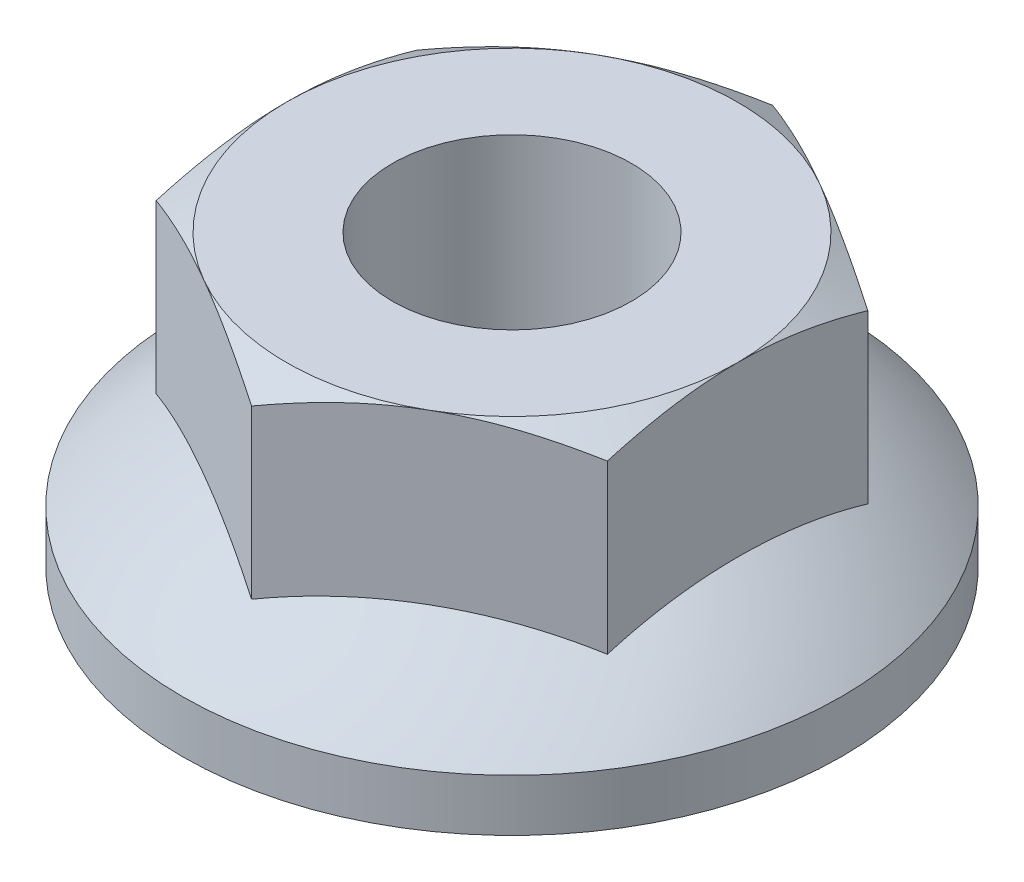
ISO-10303-21;
HEADER;
FILE_DESCRIPTION(('STEP AP214'),'2;1');
FILE_NAME('part.step','',(''),(''),'','','');
FILE_SCHEMA(('AUTOMOTIVE_DESIGN { 1 0 10303 214 1 1 1 1 }'));
ENDSEC;
DATA;
#1=APPLICATION_CONTEXT('core data for automotive mechanical design processes');
#2=APPLICATION_PROTOCOL_DEFINITION('international standard','automotive_design',2000,#1);
#3=PRODUCT_CONTEXT('',#1,'mechanical');
#4=PRODUCT('Part','Part','',(#3));
#5=PRODUCT_RELATED_PRODUCT_CATEGORY('part','',(#4));
#6=PRODUCT_DEFINITION_FORMATION('','',#4);
#7=PRODUCT_DEFINITION_CONTEXT('part definition',#1,'design');
#8=PRODUCT_DEFINITION('design','',#6,#7);
#9=PRODUCT_DEFINITION_SHAPE('','',#8);
#10=(LENGTH_UNIT() NAMED_UNIT(*) SI_UNIT(.MILLI.,.METRE.));
#11=(NAMED_UNIT(*) PLANE_ANGLE_UNIT() SI_UNIT($,.RADIAN.));
#12=(NAMED_UNIT(*) SI_UNIT($,.STERADIAN.) SOLID_ANGLE_UNIT());
#13=UNCERTAINTY_MEASURE_WITH_UNIT(LENGTH_MEASURE(1.E-05),#10,'distance_accuracy_value','');
#14=(GEOMETRIC_REPRESENTATION_CONTEXT(3) GLOBAL_UNCERTAINTY_ASSIGNED_CONTEXT((#13)) GLOBAL_UNIT_ASSIGNED_CONTEXT((#10,
#11,#12)) REPRESENTATION_CONTEXT('',''));
#15=CARTESIAN_POINT('',(0.,0.,0.));
#16=DIRECTION('',(0.,0.,1.));
#17=DIRECTION('',(1.,0.,0.));
#18=AXIS2_PLACEMENT_3D('',#15,#16,#17);
#19=CARTESIAN_POINT('',(0.,-5.78571428571428,0.));
#20=DIRECTION('',(0.,1.,0.));
#21=DIRECTION('',(1.,0.,0.));
#22=AXIS2_PLACEMENT_3D('',#19,#20,#21);
#23=SPHERICAL_SURFACE('',#22,8.78571428571428);
#24=CARTESIAN_POINT('',(1.95,-5.78571428571428,3.37749907475931));
#25=DIRECTION('',(0.5,0.,0.866025403784439));
#26=DIRECTION('',(0.866025403784439,0.,-0.5));
#27=AXIS2_PLACEMENT_3D('',#24,#25,#26);
#28=CIRCLE('',#27,7.87266000219774);
#29=CARTESIAN_POINT('',(0.,1.75807624095094,4.50333209967908));
#30=VERTEX_POINT('',#29);
#31=CARTESIAN_POINT('',(3.9,1.75807624095094,2.25166604983954));
#32=VERTEX_POINT('',#31);
#33=EDGE_CURVE('E233',#30,#32,#28,.F.);
#34=ORIENTED_EDGE('',*,*,#33,.F.);
#35=CARTESIAN_POINT('',(-1.95,-5.78571428571428,3.37749907475931));
#36=DIRECTION('',(-0.5,0.,0.866025403784439));
#37=DIRECTION('',(0.866025403784439,0.,0.5));
#38=AXIS2_PLACEMENT_3D('',#35,#36,#37);
#39=CIRCLE('',#38,7.87266000219774);
#40=CARTESIAN_POINT('',(-3.9,1.75807624095094,2.25166604983954));
#41=VERTEX_POINT('',#40);
#42=EDGE_CURVE('E256',#41,#30,#39,.F.);
#43=ORIENTED_EDGE('',*,*,#42,.F.);
#44=CARTESIAN_POINT('',(-3.9,-5.78571428571428,0.));
#45=DIRECTION('',(-1.,0.,0.));
#46=DIRECTION('',(0.,0.,1.));
#47=AXIS2_PLACEMENT_3D('',#44,#45,#46);
#48=CIRCLE('',#47,7.87266000219774);
#49=CARTESIAN_POINT('',(-3.9,1.75807624095094,-2.25166604983954));
#50=VERTEX_POINT('',#49);
#51=EDGE_CURVE('E253',#50,#41,#48,.F.);
#52=ORIENTED_EDGE('',*,*,#51,.F.);
#53=CARTESIAN_POINT('',(-1.95,-5.78571428571428,-3.37749907475931));
#54=DIRECTION('',(-0.5,0.,-0.866025403784438));
#55=DIRECTION('',(-0.866025403784438,0.,0.5));
#56=AXIS2_PLACEMENT_3D('',#53,#54,#55);
#57=CIRCLE('',#56,7.87266000219774);
#58=CARTESIAN_POINT('',(0.,1.75807624095094,-4.50333209967908));
#59=VERTEX_POINT('',#58);
#60=EDGE_CURVE('E250',#59,#50,#57,.F.);
#61=ORIENTED_EDGE('',*,*,#60,.F.);
#62=CARTESIAN_POINT('',(1.95,-5.78571428571428,-3.37749907475931));
#63=DIRECTION('',(0.5,0.,-0.866025403784439));
#64=DIRECTION('',(-0.866025403784439,0.,-0.5));
#65=AXIS2_PLACEMENT_3D('',#62,#63,#64);
#66=CIRCLE('',#65,7.87266000219774);
#67=CARTESIAN_POINT('',(3.9,1.75807624095094,-2.25166604983954));
#68=VERTEX_POINT('',#67);
#69=EDGE_CURVE('E247',#68,#59,#66,.F.);
#70=ORIENTED_EDGE('',*,*,#69,.F.);
#71=CARTESIAN_POINT('',(3.9,-5.78571428571428,0.));
#72=DIRECTION('',(1.,0.,0.));
#73=DIRECTION('',(0.,0.,-1.));
#74=AXIS2_PLACEMENT_3D('',#71,#72,#73);
#75=CIRCLE('',#74,7.87266000219774);
#76=EDGE_CURVE('E244',#32,#68,#75,.F.);
#77=ORIENTED_EDGE('',*,*,#76,.F.);
#78=EDGE_LOOP('',(#34,#43,#52,#61,#70,#77));
#79=FACE_BOUND('',#78,.T.);
#80=CARTESIAN_POINT('',(0.,0.899999999999998,0.));
#81=DIRECTION('',(0.,1.,0.));
#82=DIRECTION('',(0.,0.,1.));
#83=AXIS2_PLACEMENT_3D('',#80,#81,#82);
#84=CIRCLE('',#83,5.7);
#85=CARTESIAN_POINT('',(0.,0.899999999999998,5.7));
#86=VERTEX_POINT('',#85);
#87=EDGE_CURVE('E237',#86,#86,#84,.T.);
#88=ORIENTED_EDGE('',*,*,#87,.T.);
#89=EDGE_LOOP('',(#88));
#90=FACE_BOUND('',#89,.T.);
#91=ADVANCED_FACE('F38',(#79,#90),#23,.T.);
#92=CARTESIAN_POINT('',(0.,55.,0.));
#93=DIRECTION('',(0.,1.,0.));
#94=DIRECTION('',(0.,0.,1.));
#95=AXIS2_PLACEMENT_3D('',#92,#93,#94);
#96=CYLINDRICAL_SURFACE('',#95,5.7);
#97=CARTESIAN_POINT('',(0.,0.,0.));
#98=DIRECTION('',(0.,1.,0.));
#99=DIRECTION('',(0.,0.,1.));
#100=AXIS2_PLACEMENT_3D('',#97,#98,#99);
#101=CIRCLE('',#100,5.7);
#102=CARTESIAN_POINT('',(0.,0.,5.7));
#103=VERTEX_POINT('',#102);
#104=EDGE_CURVE('E239',#103,#103,#101,.T.);
#105=ORIENTED_EDGE('',*,*,#104,.T.);
#106=EDGE_LOOP('',(#105));
#107=FACE_BOUND('',#106,.T.);
#108=ORIENTED_EDGE('',*,*,#87,.F.);
#109=EDGE_LOOP('',(#108));
#110=FACE_BOUND('',#109,.T.);
#111=ADVANCED_FACE('F222',(#107,#110),#96,.T.);
#112=CARTESIAN_POINT('',(0.,0.,0.));
#113=DIRECTION('',(0.,-1.,0.));
#114=DIRECTION('',(0.,0.,-1.));
#115=AXIS2_PLACEMENT_3D('',#112,#113,#114);
#116=PLANE('',#115);
#117=CARTESIAN_POINT('',(0.,0.,0.));
#118=DIRECTION('',(0.,1.,0.));
#119=DIRECTION('',(0.,0.,1.));
#120=AXIS2_PLACEMENT_3D('',#117,#118,#119);
#121=CIRCLE('',#120,2.067);
#122=CARTESIAN_POINT('',(0.,0.,2.067));
#123=VERTEX_POINT('',#122);
#124=EDGE_CURVE('E128',#123,#123,#121,.T.);
#125=ORIENTED_EDGE('',*,*,#124,.T.);
#126=EDGE_LOOP('',(#125));
#127=FACE_BOUND('',#126,.T.);
#128=ORIENTED_EDGE('',*,*,#104,.F.);
#129=EDGE_LOOP('',(#128));
#130=FACE_BOUND('',#129,.T.);
#131=ADVANCED_FACE('F227',(#127,#130),#116,.T.);
#132=CARTESIAN_POINT('',(3.9,5.,2.25166604983954));
#133=DIRECTION('',(0.5,0.,0.866025403784439));
#134=DIRECTION('',(0.866025403784439,0.,-0.5));
#135=AXIS2_PLACEMENT_3D('',#132,#133,#134);
#136=PLANE('',#135);
#137=CARTESIAN_POINT('',(-0.000200000000000082,4.65159938060884,4.50344756973292));
#138=CARTESIAN_POINT('',(0.171184755948663,4.7087485432908,4.40449853475096));
#139=CARTESIAN_POINT('',(0.344048895227203,4.76072355207449,4.30469537740526));
#140=CARTESIAN_POINT('',(0.692770475854431,4.85144628830391,4.1033608789579));
#141=CARTESIAN_POINT('',(0.868634113331803,4.89016192166708,4.00182596051967));
#142=CARTESIAN_POINT('',(1.21818189703585,4.95042822234695,3.8000144535035));
#143=CARTESIAN_POINT('',(1.39181226217759,4.97237999753731,3.69976891544943));
#144=CARTESIAN_POINT('',(1.73988995117111,4.9985854749427,3.49880616801012));
#145=CARTESIAN_POINT('',(1.91433600991871,5.00286087795652,3.39808968903312));
#146=CARTESIAN_POINT('',(2.24029611773847,4.99396488127702,3.2098965330383));
#147=CARTESIAN_POINT('',(2.39185897047853,4.98297774999823,3.12239167920968));
#148=CARTESIAN_POINT('',(2.69399724856389,4.94815551398196,2.94795206302461));
#149=CARTESIAN_POINT('',(2.84457162893063,4.92430851477371,2.86101790398681));
#150=CARTESIAN_POINT('',(3.14733282069943,4.86469306648916,2.68621864841892));
#151=CARTESIAN_POINT('',(3.29948131430489,4.8286719181888,2.59837567467901));
#152=CARTESIAN_POINT('',(3.60150908691111,4.74691815520425,2.42399985886207));
#153=CARTESIAN_POINT('',(3.75139223511225,4.70120474892166,2.33746478290115));
#154=CARTESIAN_POINT('',(3.9002,4.65159938060884,2.2515505797857));
#155=B_SPLINE_CURVE_WITH_KNOTS('',3,(#137,#138,#139,#140,#141,#142,#143,#144,#145,#146,#147,
#148,#149,#150,#151,#152,#153,#154),.UNSPECIFIED.,.F.,.F.,(4,2,2,2,2,2,2,2,4),(0.,
0.618197035132391,1.23788000142301,1.8422261918665,2.44583022230471,2.97139286484403,
3.49744245160843,4.03516045034723,4.57182258173635),.UNSPECIFIED.);
#156=CARTESIAN_POINT('',(0.,4.65166604983954,4.50333209967908));
#157=VERTEX_POINT('',#156);
#158=CARTESIAN_POINT('',(1.95,5.,3.37749907475931));
#159=VERTEX_POINT('',#158);
#160=EDGE_CURVE('E106',#157,#159,#155,.T.);
#161=ORIENTED_EDGE('',*,*,#160,.F.);
#162=DIRECTION('',(0.,-1.,0.));
#163=VECTOR('',#162,1.);
#164=CARTESIAN_POINT('',(0.,5.,4.50333209967908));
#165=LINE('',#164,#163);
#166=EDGE_CURVE('E116',#157,#30,#165,.T.);
#167=ORIENTED_EDGE('',*,*,#166,.T.);
#168=ORIENTED_EDGE('',*,*,#33,.T.);
#169=DIRECTION('',(0.,-1.,0.));
#170=VECTOR('',#169,1.);
#171=CARTESIAN_POINT('',(3.9,5.,2.25166604983954));
#172=LINE('',#171,#170);
#173=CARTESIAN_POINT('',(3.9,4.65166604983954,2.25166604983954));
#174=VERTEX_POINT('',#173);
#175=EDGE_CURVE('E136',#174,#32,#172,.T.);
#176=ORIENTED_EDGE('',*,*,#175,.F.);
#177=EDGE_CURVE('E117',#159,#174,#155,.T.);
#178=ORIENTED_EDGE('',*,*,#177,.F.);
#179=EDGE_LOOP('',(#161,#167,#168,#176,#178));
#180=FACE_BOUND('',#179,.T.);
#181=ADVANCED_FACE('F134',(#180),#136,.T.);
#182=CARTESIAN_POINT('',(3.9,5.,-2.25166604983954));
#183=DIRECTION('',(1.,0.,0.));
#184=DIRECTION('',(0.,0.,-1.));
#185=AXIS2_PLACEMENT_3D('',#182,#183,#184);
#186=PLANE('',#185);
#187=CARTESIAN_POINT('',(3.9,3.07917792629661,-6.08432177184287));
#188=CARTESIAN_POINT('',(3.9,3.1620981895609,-5.91368140178134));
#189=CARTESIAN_POINT('',(3.9,3.24423377045389,-5.7426531777552));
#190=CARTESIAN_POINT('',(3.9,3.40649497934568,-5.39961491114535));
#191=CARTESIAN_POINT('',(3.9,3.48662029758723,-5.22760472220462));
#192=CARTESIAN_POINT('',(3.9,3.64481583556669,-4.8815273093431));
#193=CARTESIAN_POINT('',(3.9,3.72287280136912,-4.70745400621611));
#194=CARTESIAN_POINT('',(3.9,3.87584038658809,-4.35793550270963));
#195=CARTESIAN_POINT('',(3.9,3.950751152236,-4.18249036654178));
#196=CARTESIAN_POINT('',(3.9,4.09900019028108,-3.82414006320308));
#197=CARTESIAN_POINT('',(3.9,4.17220536925185,-3.64117953708319));
#198=CARTESIAN_POINT('',(3.9,4.31316212940151,-3.27313126153532));
#199=CARTESIAN_POINT('',(3.9,4.38091310354078,-3.08804327793909));
#200=CARTESIAN_POINT('',(3.9,4.50920922127308,-2.71578063532756));
#201=CARTESIAN_POINT('',(3.9,4.56976864749844,-2.52861094798131));
#202=CARTESIAN_POINT('',(3.9,4.68176218466094,-2.15158666244942));
#203=CARTESIAN_POINT('',(3.9,4.73319913202587,-1.96173291870356));
#204=CARTESIAN_POINT('',(3.9,4.82422595411218,-1.58029898099176));
#205=CARTESIAN_POINT('',(3.9,4.86388168140834,-1.38873479456714));
#206=CARTESIAN_POINT('',(3.9,4.92913241508771,-1.00318642113787));
#207=CARTESIAN_POINT('',(3.9,4.95472880998371,-0.809202475046858));
#208=CARTESIAN_POINT('',(3.9,4.98948534774504,-0.422331919835105));
#209=CARTESIAN_POINT('',(3.9,4.99885956393458,-0.229465029674007));
#210=CARTESIAN_POINT('',(3.9,5.00094273264838,0.156375622946879));
#211=CARTESIAN_POINT('',(3.9,4.99365146262056,0.349349386799463));
#212=CARTESIAN_POINT('',(3.9,4.96773130495737,0.675902537095185));
#213=CARTESIAN_POINT('',(3.9,4.95318922276409,0.809826843464921));
#214=CARTESIAN_POINT('',(3.9,4.91696428480891,1.0767127390436));
#215=CARTESIAN_POINT('',(3.9,4.89528048799788,1.20967419901933));
#216=CARTESIAN_POINT('',(3.9,4.82065430217073,1.60692794758031));
#217=CARTESIAN_POINT('',(3.9,4.75815013897267,1.86944499791454));
#218=CARTESIAN_POINT('',(3.9,4.64954364169666,2.26201758457893));
#219=CARTESIAN_POINT('',(3.9,4.61035647054217,2.39410235633202));
#220=CARTESIAN_POINT('',(3.9,4.52785595123815,2.65698935483899));
#221=CARTESIAN_POINT('',(3.9,4.48454257542994,2.78779157298919));
#222=CARTESIAN_POINT('',(3.9,4.39448935088307,3.04815370956295));
#223=CARTESIAN_POINT('',(3.9,4.34775059286303,3.17771400870979));
#224=CARTESIAN_POINT('',(3.9,4.25140203199345,3.4357575315207));
#225=CARTESIAN_POINT('',(3.9,4.20179226558378,3.56424076883152));
#226=CARTESIAN_POINT('',(3.9,4.07990434010133,3.8713248113076));
#227=CARTESIAN_POINT('',(3.9,4.0064789070627,4.04946944510241));
#228=CARTESIAN_POINT('',(3.9,3.85595449207032,4.40420470587554));
#229=CARTESIAN_POINT('',(3.9,3.77885526712492,4.58079522914429));
#230=CARTESIAN_POINT('',(3.9,3.62173416571981,4.93271412207387));
#231=CARTESIAN_POINT('',(3.9,3.5417116524511,5.10804220664676));
#232=CARTESIAN_POINT('',(3.9,3.37933503891529,5.45761707415352));
#233=CARTESIAN_POINT('',(3.9,3.29698088567242,5.63186383240939));
#234=CARTESIAN_POINT('',(3.9,3.04692511116692,6.15365090231731));
#235=CARTESIAN_POINT('',(3.9,2.87640966500424,6.4998417990242));
#236=CARTESIAN_POINT('',(3.9,2.53036940246811,7.18963705346156));
#237=CARTESIAN_POINT('',(3.9,2.35484523973633,7.53324174136513));
#238=CARTESIAN_POINT('',(3.9,2.01551141266023,8.18909122007097));
#239=CARTESIAN_POINT('',(3.9,1.8519949261735,8.50148798480561));
#240=CARTESIAN_POINT('',(3.9,1.52273598453401,9.12511955233899));
#241=CARTESIAN_POINT('',(3.9,1.35699344446375,9.43635431022844));
#242=CARTESIAN_POINT('',(3.9,1.02425312936935,10.0571028576461));
#243=CARTESIAN_POINT('',(3.9,0.857259774122418,10.3666190193858));
#244=CARTESIAN_POINT('',(3.9,0.521949337141364,10.9849104967807));
#245=CARTESIAN_POINT('',(3.9,0.353632333020366,11.2936858545082));
#246=CARTESIAN_POINT('',(3.9,0.184823057742641,11.602189863334));
#247=B_SPLINE_CURVE_WITH_KNOTS('',3,(#187,#188,#189,#190,#191,#192,#193,#194,#195,#196,#197,
#198,#199,#200,#201,#202,#203,#204,#205,#206,#207,#208,#209,#210,#211,#212,#213,#214,#215,#216,
#217,#218,#219,#220,#221,#222,#223,#224,#225,#226,#227,#228,#229,#230,#231,#232,#233,#234,#235,
#236,#237,#238,#239,#240,#241,#242,#243,#244,#245,#246),.UNSPECIFIED.,.F.,.F.,(4,2,2,2,2,2,2,2,
2,2,2,2,2,2,2,2,2,2,2,2,2,2,2,2,2,2,2,2,2,4),(0.,0.569168580260882,1.13842433050601,
1.71071890667252,2.28298685381383,2.87410654280125,3.46529193126533,4.05528284332578,
4.64508998825942,5.23153547093413,5.81792302528702,6.39651166541883,6.97510803210922,
7.37904725542088,7.78303972628634,8.5914582612306,9.00474817923754,9.4180408677964,
9.83120252173289,10.2443589328241,10.8223523046405,11.4003839592605,11.9785422920706,
12.5567137714204,13.7143613219592,14.8718584832686,15.9296577137364,16.987497411453,
18.0425688880894,19.0975789543823),.UNSPECIFIED.);
#248=CARTESIAN_POINT('',(3.9,5.,0.));
#249=VERTEX_POINT('',#248);
#250=EDGE_CURVE('E124',#174,#249,#247,.F.);
#251=ORIENTED_EDGE('',*,*,#250,.F.);
#252=ORIENTED_EDGE('',*,*,#175,.T.);
#253=ORIENTED_EDGE('',*,*,#76,.T.);
#254=DIRECTION('',(0.,-1.,0.));
#255=VECTOR('',#254,1.);
#256=CARTESIAN_POINT('',(3.9,5.,-2.25166604983954));
#257=LINE('',#256,#255);
#258=CARTESIAN_POINT('',(3.9,4.65166604983954,-2.25166604983954));
#259=VERTEX_POINT('',#258);
#260=EDGE_CURVE('E264',#259,#68,#257,.T.);
#261=ORIENTED_EDGE('',*,*,#260,.F.);
#262=EDGE_CURVE('E137',#249,#259,#247,.F.);
#263=ORIENTED_EDGE('',*,*,#262,.F.);
#264=EDGE_LOOP('',(#251,#252,#253,#261,#263));
#265=FACE_BOUND('',#264,.T.);
#266=ADVANCED_FACE('F200',(#265),#186,.T.);
#267=CARTESIAN_POINT('',(0.,5.,-4.50333209967908));
#268=DIRECTION('',(0.5,0.,-0.866025403784439));
#269=DIRECTION('',(-0.866025403784439,0.,-0.5));
#270=AXIS2_PLACEMENT_3D('',#267,#268,#269);
#271=PLANE('',#270);
#272=CARTESIAN_POINT('',(3.9002,4.65159938060884,-2.2515505797857));
#273=CARTESIAN_POINT('',(3.72881524405134,4.7087485432908,-2.35049961476766));
#274=CARTESIAN_POINT('',(3.5559511047728,4.76072355207449,-2.45030277211336));
#275=CARTESIAN_POINT('',(3.20722952414557,4.85144628830391,-2.65163727056072));
#276=CARTESIAN_POINT('',(3.03136588666819,4.89016192166708,-2.75317218899895));
#277=CARTESIAN_POINT('',(2.68181810296414,4.95042822234695,-2.95498369601512));
#278=CARTESIAN_POINT('',(2.50818773782241,4.97237999753731,-3.0552292340692));
#279=CARTESIAN_POINT('',(2.16011004882889,4.9985854749427,-3.25619198150851));
#280=CARTESIAN_POINT('',(1.98566399008129,5.00286087795652,-3.3569084604855));
#281=CARTESIAN_POINT('',(1.65970388226153,4.99396488127702,-3.54510161648032));
#282=CARTESIAN_POINT('',(1.50814102952147,4.98297774999823,-3.63260647030894));
#283=CARTESIAN_POINT('',(1.20600275143611,4.94815551398196,-3.80704608649401));
#284=CARTESIAN_POINT('',(1.05542837106937,4.92430851477371,-3.89398024553181));
#285=CARTESIAN_POINT('',(0.752667179300567,4.86469306648916,-4.0687795010997));
#286=CARTESIAN_POINT('',(0.600518685695105,4.8286719181888,-4.15662247483961));
#287=CARTESIAN_POINT('',(0.298490913088887,4.74691815520425,-4.33099829065655));
#288=CARTESIAN_POINT('',(0.14860776488775,4.70120474892166,-4.41753336661747));
#289=CARTESIAN_POINT('',(-0.000200000000000154,4.65159938060884,-4.50344756973292));
#290=B_SPLINE_CURVE_WITH_KNOTS('',3,(#272,#273,#274,#275,#276,#277,#278,#279,#280,#281,#282,
#283,#284,#285,#286,#287,#288,#289),.UNSPECIFIED.,.F.,.F.,(4,2,2,2,2,2,2,2,4),(0.,
0.618197035132391,1.237880001423,1.8422261918665,2.44583022230471,2.97139286484403,
3.49744245160843,4.03516045034723,4.57182258173635),.UNSPECIFIED.);
#291=CARTESIAN_POINT('',(1.95,5.,-3.37749907475931));
#292=VERTEX_POINT('',#291);
#293=EDGE_CURVE('E194',#259,#292,#290,.T.);
#294=ORIENTED_EDGE('',*,*,#293,.F.);
#295=ORIENTED_EDGE('',*,*,#260,.T.);
#296=ORIENTED_EDGE('',*,*,#69,.T.);
#297=DIRECTION('',(0.,-1.,0.));
#298=VECTOR('',#297,1.);
#299=CARTESIAN_POINT('',(0.,5.,-4.50333209967908));
#300=LINE('',#299,#298);
#301=CARTESIAN_POINT('',(0.,4.65166604983954,-4.50333209967908));
#302=VERTEX_POINT('',#301);
#303=EDGE_CURVE('E263',#302,#59,#300,.T.);
#304=ORIENTED_EDGE('',*,*,#303,.F.);
#305=EDGE_CURVE('E188',#292,#302,#290,.T.);
#306=ORIENTED_EDGE('',*,*,#305,.F.);
#307=EDGE_LOOP('',(#294,#295,#296,#304,#306));
#308=FACE_BOUND('',#307,.T.);
#309=ADVANCED_FACE('F196',(#308),#271,.T.);
#310=CARTESIAN_POINT('',(-3.9,5.,-2.25166604983954));
#311=DIRECTION('',(-0.5,0.,-0.866025403784438));
#312=DIRECTION('',(-0.866025403784438,0.,0.5));
#313=AXIS2_PLACEMENT_3D('',#310,#311,#312);
#314=PLANE('',#313);
#315=CARTESIAN_POINT('',(0.000199999999999611,4.65159938060884,-4.50344756973292));
#316=CARTESIAN_POINT('',(-0.171184755948662,4.7087485432908,-4.40449853475096));
#317=CARTESIAN_POINT('',(-0.344048895227202,4.76072355207449,-4.30469537740526));
#318=CARTESIAN_POINT('',(-0.692770475854432,4.85144628830391,-4.1033608789579));
#319=CARTESIAN_POINT('',(-0.868634113331803,4.89016192166708,-4.00182596051967));
#320=CARTESIAN_POINT('',(-1.21818189703585,4.95042822234695,-3.8000144535035));
#321=CARTESIAN_POINT('',(-1.39181226217759,4.97237999753731,-3.69976891544943));
#322=CARTESIAN_POINT('',(-1.73988995117111,4.9985854749427,-3.49880616801011));
#323=CARTESIAN_POINT('',(-1.91433600991871,5.00286087795652,-3.39808968903312));
#324=CARTESIAN_POINT('',(-2.24029611773847,4.99396488127702,-3.2098965330383));
#325=CARTESIAN_POINT('',(-2.39185897047853,4.98297774999823,-3.12239167920968));
#326=CARTESIAN_POINT('',(-2.69399724856389,4.94815551398196,-2.94795206302461));
#327=CARTESIAN_POINT('',(-2.84457162893063,4.92430851477371,-2.86101790398681));
#328=CARTESIAN_POINT('',(-3.14733282069943,4.86469306648916,-2.68621864841892));
#329=CARTESIAN_POINT('',(-3.29948131430489,4.8286719181888,-2.59837567467901));
#330=CARTESIAN_POINT('',(-3.60150908691111,4.74691815520425,-2.42399985886207));
#331=CARTESIAN_POINT('',(-3.75139223511225,4.70120474892166,-2.33746478290115));
#332=CARTESIAN_POINT('',(-3.9002,4.65159938060884,-2.2515505797857));
#333=B_SPLINE_CURVE_WITH_KNOTS('',3,(#315,#316,#317,#318,#319,#320,#321,#322,#323,#324,#325,
#326,#327,#328,#329,#330,#331,#332),.UNSPECIFIED.,.F.,.F.,(4,2,2,2,2,2,2,2,4),(0.,
0.618197035132391,1.23788000142301,1.8422261918665,2.44583022230471,2.97139286484403,
3.49744245160843,4.03516045034724,4.57182258173636),.UNSPECIFIED.);
#334=CARTESIAN_POINT('',(-1.95,5.,-3.37749907475931));
#335=VERTEX_POINT('',#334);
#336=EDGE_CURVE('E195',#302,#335,#333,.T.);
#337=ORIENTED_EDGE('',*,*,#336,.F.);
#338=ORIENTED_EDGE('',*,*,#303,.T.);
#339=ORIENTED_EDGE('',*,*,#60,.T.);
#340=DIRECTION('',(0.,-1.,0.));
#341=VECTOR('',#340,1.);
#342=CARTESIAN_POINT('',(-3.9,5.,-2.25166604983954));
#343=LINE('',#342,#341);
#344=CARTESIAN_POINT('',(-3.9,4.6516660498398,-2.25166604983993));
#345=VERTEX_POINT('',#344);
#346=EDGE_CURVE('E261',#345,#50,#343,.T.);
#347=ORIENTED_EDGE('',*,*,#346,.F.);
#348=EDGE_CURVE('E182',#335,#345,#333,.T.);
#349=ORIENTED_EDGE('',*,*,#348,.F.);
#350=EDGE_LOOP('',(#337,#338,#339,#347,#349));
#351=FACE_BOUND('',#350,.T.);
#352=ADVANCED_FACE('F199',(#351),#314,.T.);
#353=CARTESIAN_POINT('',(-3.9,5.,2.25166604983954));
#354=DIRECTION('',(-1.,0.,0.));
#355=DIRECTION('',(0.,0.,1.));
#356=AXIS2_PLACEMENT_3D('',#353,#354,#355);
#357=PLANE('',#356);
#358=CARTESIAN_POINT('',(-3.9,3.07917792629661,-6.08432177184287));
#359=CARTESIAN_POINT('',(-3.9,3.1620981895609,-5.91368140178134));
#360=CARTESIAN_POINT('',(-3.9,3.24423377045389,-5.7426531777552));
#361=CARTESIAN_POINT('',(-3.9,3.40649497934568,-5.39961491114535));
#362=CARTESIAN_POINT('',(-3.9,3.48662029758723,-5.22760472220462));
#363=CARTESIAN_POINT('',(-3.9,3.64481583556669,-4.8815273093431));
#364=CARTESIAN_POINT('',(-3.9,3.72287280136912,-4.70745400621611));
#365=CARTESIAN_POINT('',(-3.9,3.87584038658809,-4.35793550270963));
#366=CARTESIAN_POINT('',(-3.9,3.950751152236,-4.18249036654178));
#367=CARTESIAN_POINT('',(-3.9,4.09900019028108,-3.82414006320308));
#368=CARTESIAN_POINT('',(-3.9,4.17220536925185,-3.64117953708319));
#369=CARTESIAN_POINT('',(-3.9,4.31316212940151,-3.27313126153532));
#370=CARTESIAN_POINT('',(-3.9,4.38091310354078,-3.08804327793909));
#371=CARTESIAN_POINT('',(-3.9,4.50920922127308,-2.71578063532756));
#372=CARTESIAN_POINT('',(-3.9,4.56976864749844,-2.52861094798131));
#373=CARTESIAN_POINT('',(-3.9,4.68176218466094,-2.15158666244941));
#374=CARTESIAN_POINT('',(-3.9,4.73319913202587,-1.96173291870356));
#375=CARTESIAN_POINT('',(-3.9,4.82422595411218,-1.58029898099176));
#376=CARTESIAN_POINT('',(-3.9,4.86388168140834,-1.38873479456714));
#377=CARTESIAN_POINT('',(-3.9,4.92913241508771,-1.00318642113787));
#378=CARTESIAN_POINT('',(-3.9,4.95472880998371,-0.809202475046855));
#379=CARTESIAN_POINT('',(-3.9,4.98948534774504,-0.422331919835101));
#380=CARTESIAN_POINT('',(-3.9,4.99885956393457,-0.229465029674004));
#381=CARTESIAN_POINT('',(-3.9,5.00094273264838,0.156375622946883));
#382=CARTESIAN_POINT('',(-3.9,4.99365146262056,0.349349386799466));
#383=CARTESIAN_POINT('',(-3.9,4.96773130495737,0.675902537095188));
#384=CARTESIAN_POINT('',(-3.9,4.95318922276409,0.809826843464924));
#385=CARTESIAN_POINT('',(-3.9,4.91696428480891,1.07671273904361));
#386=CARTESIAN_POINT('',(-3.9,4.89528048799788,1.20967419901934));
#387=CARTESIAN_POINT('',(-3.9,4.82065430217072,1.60692794758032));
#388=CARTESIAN_POINT('',(-3.9,4.75815013897267,1.86944499791455));
#389=CARTESIAN_POINT('',(-3.9,4.64954364169665,2.26201758457893));
#390=CARTESIAN_POINT('',(-3.9,4.61035647054216,2.39410235633203));
#391=CARTESIAN_POINT('',(-3.9,4.52785595123815,2.656989354839));
#392=CARTESIAN_POINT('',(-3.9,4.48454257542993,2.7877915729892));
#393=CARTESIAN_POINT('',(-3.9,4.39448935088307,3.04815370956295));
#394=CARTESIAN_POINT('',(-3.9,4.34775059286302,3.1777140087098));
#395=CARTESIAN_POINT('',(-3.9,4.25140203199344,3.4357575315207));
#396=CARTESIAN_POINT('',(-3.9,4.20179226558377,3.56424076883153));
#397=CARTESIAN_POINT('',(-3.9,4.07990434010133,3.8713248113076));
#398=CARTESIAN_POINT('',(-3.9,4.00647890706269,4.04946944510242));
#399=CARTESIAN_POINT('',(-3.9,3.85595449207032,4.40420470587555));
#400=CARTESIAN_POINT('',(-3.9,3.77885526712491,4.5807952291443));
#401=CARTESIAN_POINT('',(-3.9,3.62173416571981,4.93271412207387));
#402=CARTESIAN_POINT('',(-3.9,3.5417116524511,5.10804220664676));
#403=CARTESIAN_POINT('',(-3.9,3.37933503891529,5.45761707415352));
#404=CARTESIAN_POINT('',(-3.9,3.29698088567242,5.6318638324094));
#405=CARTESIAN_POINT('',(-3.9,3.04692511116691,6.15365090231732));
#406=CARTESIAN_POINT('',(-3.9,2.87640966500423,6.49984179902421));
#407=CARTESIAN_POINT('',(-3.9,2.5303694024681,7.18963705346156));
#408=CARTESIAN_POINT('',(-3.9,2.35484523973633,7.53324174136513));
#409=CARTESIAN_POINT('',(-3.9,2.01551141266023,8.18909122007097));
#410=CARTESIAN_POINT('',(-3.9,1.8519949261735,8.50148798480561));
#411=CARTESIAN_POINT('',(-3.9,1.52273598453401,9.12511955233899));
#412=CARTESIAN_POINT('',(-3.9,1.35699344446375,9.43635431022844));
#413=CARTESIAN_POINT('',(-3.9,1.02425312936935,10.0571028576461));
#414=CARTESIAN_POINT('',(-3.9,0.857259774122417,10.3666190193858));
#415=CARTESIAN_POINT('',(-3.9,0.521949337141363,10.9849104967807));
#416=CARTESIAN_POINT('',(-3.9,0.353632333020364,11.2936858545082));
#417=CARTESIAN_POINT('',(-3.9,0.18482305774264,11.602189863334));
#418=B_SPLINE_CURVE_WITH_KNOTS('',3,(#358,#359,#360,#361,#362,#363,#364,#365,#366,#367,#368,
#369,#370,#371,#372,#373,#374,#375,#376,#377,#378,#379,#380,#381,#382,#383,#384,#385,#386,#387,
#388,#389,#390,#391,#392,#393,#394,#395,#396,#397,#398,#399,#400,#401,#402,#403,#404,#405,#406,
#407,#408,#409,#410,#411,#412,#413,#414,#415,#416,#417),.UNSPECIFIED.,.F.,.F.,(4,2,2,2,2,2,2,2,
2,2,2,2,2,2,2,2,2,2,2,2,2,2,2,2,2,2,2,2,2,4),(0.,0.569168580260881,1.13842433050601,
1.71071890667252,2.28298685381383,2.87410654280125,3.46529193126533,4.05528284332578,
4.64508998825942,5.23153547093413,5.81792302528702,6.39651166541884,6.97510803210923,
7.37904725542089,7.78303972628634,8.5914582612306,9.00474817923754,9.41804086779641,
9.83120252173289,10.2443589328241,10.8223523046405,11.4003839592605,11.9785422920706,
12.5567137714204,13.7143613219592,14.8718584832686,15.9296577137364,16.987497411453,
18.0425688880894,19.0975789543823),.UNSPECIFIED.);
#419=CARTESIAN_POINT('',(-3.9,5.,0.));
#420=VERTEX_POINT('',#419);
#421=EDGE_CURVE('E275',#345,#420,#418,.T.);
#422=ORIENTED_EDGE('',*,*,#421,.F.);
#423=ORIENTED_EDGE('',*,*,#346,.T.);
#424=ORIENTED_EDGE('',*,*,#51,.T.);
#425=DIRECTION('',(0.,-1.,0.));
#426=VECTOR('',#425,1.);
#427=CARTESIAN_POINT('',(-3.9,5.,2.25166604983954));
#428=LINE('',#427,#426);
#429=CARTESIAN_POINT('',(-3.9,4.65166604983954,2.25166604983954));
#430=VERTEX_POINT('',#429);
#431=EDGE_CURVE('E259',#430,#41,#428,.T.);
#432=ORIENTED_EDGE('',*,*,#431,.F.);
#433=EDGE_CURVE('E174',#420,#430,#418,.T.);
#434=ORIENTED_EDGE('',*,*,#433,.F.);
#435=EDGE_LOOP('',(#422,#423,#424,#432,#434));
#436=FACE_BOUND('',#435,.T.);
#437=ADVANCED_FACE('F205',(#436),#357,.T.);
#438=CARTESIAN_POINT('',(0.,5.,4.50333209967908));
#439=DIRECTION('',(-0.5,0.,0.866025403784439));
#440=DIRECTION('',(0.866025403784439,0.,0.5));
#441=AXIS2_PLACEMENT_3D('',#438,#439,#440);
#442=PLANE('',#441);
#443=CARTESIAN_POINT('',(-3.9002,4.65159938060884,2.2515505797857));
#444=CARTESIAN_POINT('',(-3.72881524405134,4.7087485432908,2.35049961476766));
#445=CARTESIAN_POINT('',(-3.5559511047728,4.76072355207449,2.45030277211336));
#446=CARTESIAN_POINT('',(-3.20722952414557,4.85144628830391,2.65163727056072));
#447=CARTESIAN_POINT('',(-3.0313658866682,4.89016192166707,2.75317218899895));
#448=CARTESIAN_POINT('',(-2.68181810296415,4.95042822234695,2.95498369601512));
#449=CARTESIAN_POINT('',(-2.50818773782241,4.97237999753731,3.0552292340692));
#450=CARTESIAN_POINT('',(-2.16011004882889,4.9985854749427,3.25619198150851));
#451=CARTESIAN_POINT('',(-1.98566399008129,5.00286087795652,3.3569084604855));
#452=CARTESIAN_POINT('',(-1.65970388226153,4.99396488127702,3.54510161648032));
#453=CARTESIAN_POINT('',(-1.50814102952147,4.98297774999823,3.63260647030894));
#454=CARTESIAN_POINT('',(-1.20600275143611,4.94815551398196,3.80704608649401));
#455=CARTESIAN_POINT('',(-1.05542837106937,4.92430851477371,3.89398024553181));
#456=CARTESIAN_POINT('',(-0.752667179300568,4.86469306648916,4.0687795010997));
#457=CARTESIAN_POINT('',(-0.600518685695106,4.8286719181888,4.15662247483961));
#458=CARTESIAN_POINT('',(-0.298490913088888,4.74691815520425,4.33099829065656));
#459=CARTESIAN_POINT('',(-0.148607764887751,4.70120474892165,4.41753336661747));
#460=CARTESIAN_POINT('',(0.000200000000000112,4.65159938060884,4.50344756973292));
#461=B_SPLINE_CURVE_WITH_KNOTS('',3,(#443,#444,#445,#446,#447,#448,#449,#450,#451,#452,#453,
#454,#455,#456,#457,#458,#459,#460),.UNSPECIFIED.,.F.,.F.,(4,2,2,2,2,2,2,2,4),(0.,
0.618197035132391,1.23788000142301,1.8422261918665,2.44583022230471,2.97139286484403,
3.49744245160843,4.03516045034724,4.57182258173636),.UNSPECIFIED.);
#462=CARTESIAN_POINT('',(-1.95,5.,3.37749907475931));
#463=VERTEX_POINT('',#462);
#464=EDGE_CURVE('E281',#430,#463,#461,.T.);
#465=ORIENTED_EDGE('',*,*,#464,.F.);
#466=ORIENTED_EDGE('',*,*,#431,.T.);
#467=ORIENTED_EDGE('',*,*,#42,.T.);
#468=ORIENTED_EDGE('',*,*,#166,.F.);
#469=EDGE_CURVE('E112',#463,#157,#461,.T.);
#470=ORIENTED_EDGE('',*,*,#469,.F.);
#471=EDGE_LOOP('',(#465,#466,#467,#468,#470));
#472=FACE_BOUND('',#471,.T.);
#473=ADVANCED_FACE('F209',(#472),#442,.T.);
#474=CARTESIAN_POINT('',(0.,3.84529946162077,0.));
#475=DIRECTION('',(0.,-1.,0.));
#476=DIRECTION('',(0.,0.,-1.));
#477=AXIS2_PLACEMENT_3D('',#474,#475,#476);
#478=CONICAL_SURFACE('',#477,5.9,1.04719755119661);
#479=ORIENTED_EDGE('',*,*,#305,.T.);
#480=ORIENTED_EDGE('',*,*,#336,.T.);
#481=CARTESIAN_POINT('',(0.,5.,0.));
#482=DIRECTION('',(0.,-1.,0.));
#483=DIRECTION('',(0.,0.,-1.));
#484=AXIS2_PLACEMENT_3D('',#481,#482,#483);
#485=CIRCLE('',#484,3.9);
#486=EDGE_CURVE('E41',#292,#335,#485,.F.);
#487=ORIENTED_EDGE('',*,*,#486,.F.);
#488=EDGE_LOOP('',(#479,#480,#487));
#489=FACE_BOUND('',#488,.T.);
#490=ADVANCED_FACE('F213',(#489),#478,.T.);
#491=ORIENTED_EDGE('',*,*,#262,.T.);
#492=ORIENTED_EDGE('',*,*,#293,.T.);
#493=EDGE_CURVE('E132',#249,#292,#485,.F.);
#494=ORIENTED_EDGE('',*,*,#493,.F.);
#495=EDGE_LOOP('',(#491,#492,#494));
#496=FACE_BOUND('',#495,.T.);
#497=ADVANCED_FACE('F218',(#496),#478,.T.);
#498=ORIENTED_EDGE('',*,*,#177,.T.);
#499=ORIENTED_EDGE('',*,*,#250,.T.);
#500=CARTESIAN_POINT('',(0.,5.,0.));
#501=DIRECTION('',(0.,1.,0.));
#502=DIRECTION('',(0.,0.,1.));
#503=AXIS2_PLACEMENT_3D('',#500,#501,#502);
#504=CIRCLE('',#503,3.9);
#505=EDGE_CURVE('E121',#159,#249,#504,.T.);
#506=ORIENTED_EDGE('',*,*,#505,.F.);
#507=EDGE_LOOP('',(#498,#499,#506));
#508=FACE_BOUND('',#507,.T.);
#509=ADVANCED_FACE('F122',(#508),#478,.T.);
#510=ORIENTED_EDGE('',*,*,#160,.T.);
#511=EDGE_CURVE('E109',#463,#159,#485,.F.);
#512=ORIENTED_EDGE('',*,*,#511,.F.);
#513=ORIENTED_EDGE('',*,*,#469,.T.);
#514=EDGE_LOOP('',(#510,#512,#513));
#515=FACE_BOUND('',#514,.T.);
#516=ADVANCED_FACE('F108',(#515),#478,.T.);
#517=ORIENTED_EDGE('',*,*,#433,.T.);
#518=ORIENTED_EDGE('',*,*,#464,.T.);
#519=EDGE_CURVE('E46',#420,#463,#485,.F.);
#520=ORIENTED_EDGE('',*,*,#519,.F.);
#521=EDGE_LOOP('',(#517,#518,#520));
#522=FACE_BOUND('',#521,.T.);
#523=ADVANCED_FACE('F156',(#522),#478,.T.);
#524=ORIENTED_EDGE('',*,*,#348,.T.);
#525=ORIENTED_EDGE('',*,*,#421,.T.);
#526=EDGE_CURVE('E11',#335,#420,#485,.F.);
#527=ORIENTED_EDGE('',*,*,#526,.F.);
#528=EDGE_LOOP('',(#524,#525,#527));
#529=FACE_BOUND('',#528,.T.);
#530=ADVANCED_FACE('F161',(#529),#478,.T.);
#531=CARTESIAN_POINT('',(0.,5.,0.));
#532=DIRECTION('',(0.,-1.,0.));
#533=DIRECTION('',(0.,0.,-1.));
#534=AXIS2_PLACEMENT_3D('',#531,#532,#533);
#535=PLANE('',#534);
#536=CARTESIAN_POINT('',(0.,5.,0.));
#537=DIRECTION('',(0.,1.,0.));
#538=DIRECTION('',(0.,0.,1.));
#539=AXIS2_PLACEMENT_3D('',#536,#537,#538);
#540=CIRCLE('',#539,2.067);
#541=CARTESIAN_POINT('',(0.,5.,2.067));
#542=VERTEX_POINT('',#541);
#543=EDGE_CURVE('E398',#542,#542,#540,.T.);
#544=ORIENTED_EDGE('',*,*,#543,.F.);
#545=EDGE_LOOP('',(#544));
#546=FACE_BOUND('',#545,.T.);
#547=ORIENTED_EDGE('',*,*,#486,.T.);
#548=ORIENTED_EDGE('',*,*,#526,.T.);
#549=ORIENTED_EDGE('',*,*,#519,.T.);
#550=ORIENTED_EDGE('',*,*,#511,.T.);
#551=ORIENTED_EDGE('',*,*,#505,.T.);
#552=ORIENTED_EDGE('',*,*,#493,.T.);
#553=EDGE_LOOP('',(#547,#548,#549,#550,#551,#552));
#554=FACE_BOUND('',#553,.T.);
#555=ADVANCED_FACE('F131',(#546,#554),#535,.F.);
#556=CARTESIAN_POINT('',(0.,5.,0.));
#557=DIRECTION('',(0.,1.,0.));
#558=DIRECTION('',(0.,0.,1.));
#559=AXIS2_PLACEMENT_3D('',#556,#557,#558);
#560=CYLINDRICAL_SURFACE('',#559,2.067);
#561=ORIENTED_EDGE('',*,*,#124,.F.);
#562=EDGE_LOOP('',(#561));
#563=FACE_BOUND('',#562,.T.);
#564=ORIENTED_EDGE('',*,*,#543,.T.);
#565=EDGE_LOOP('',(#564));
#566=FACE_BOUND('',#565,.T.);
#567=ADVANCED_FACE('F163',(#563,#566),#560,.F.);
#568=CLOSED_SHELL('',(#91,#111,#131,#181,#266,#309,#352,#437,#473,#490,#497,#509,#516,#523,#530,
#555,#567));
#569=MANIFOLD_SOLID_BREP('B2',#568);
#570=ADVANCED_BREP_SHAPE_REPRESENTATION('',(#18,#569),#14);
#571=SHAPE_DEFINITION_REPRESENTATION(#9,#570);
ENDSEC;
END-ISO-10303-21;
